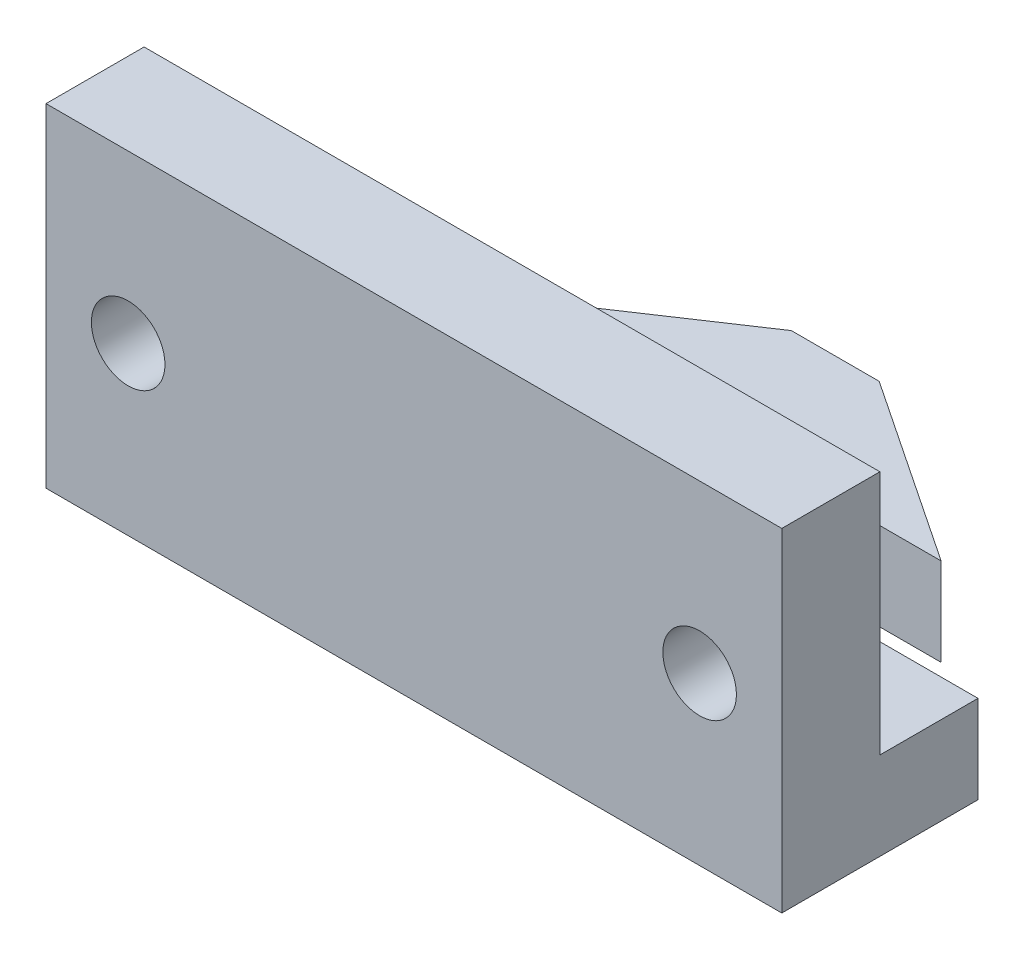
ISO-10303-21;
HEADER;
FILE_DESCRIPTION(('STEP AP214'),'2;1');
FILE_NAME('part.step','',(''),(''),'','','');
FILE_SCHEMA(('AUTOMOTIVE_DESIGN { 1 0 10303 214 1 1 1 1 }'));
ENDSEC;
DATA;
#1=APPLICATION_CONTEXT('core data for automotive mechanical design processes');
#2=APPLICATION_PROTOCOL_DEFINITION('international standard','automotive_design',2000,#1);
#3=PRODUCT_CONTEXT('',#1,'mechanical');
#4=PRODUCT('Part','Part','',(#3));
#5=PRODUCT_RELATED_PRODUCT_CATEGORY('part','',(#4));
#6=PRODUCT_DEFINITION_FORMATION('','',#4);
#7=PRODUCT_DEFINITION_CONTEXT('part definition',#1,'design');
#8=PRODUCT_DEFINITION('design','',#6,#7);
#9=PRODUCT_DEFINITION_SHAPE('','',#8);
#10=(LENGTH_UNIT() NAMED_UNIT(*) SI_UNIT(.MILLI.,.METRE.));
#11=(NAMED_UNIT(*) PLANE_ANGLE_UNIT() SI_UNIT($,.RADIAN.));
#12=(NAMED_UNIT(*) SI_UNIT($,.STERADIAN.) SOLID_ANGLE_UNIT());
#13=UNCERTAINTY_MEASURE_WITH_UNIT(LENGTH_MEASURE(1.E-05),#10,'distance_accuracy_value','');
#14=(GEOMETRIC_REPRESENTATION_CONTEXT(3) GLOBAL_UNCERTAINTY_ASSIGNED_CONTEXT((#13)) GLOBAL_UNIT_ASSIGNED_CONTEXT((#10,
#11,#12)) REPRESENTATION_CONTEXT('',''));
#15=CARTESIAN_POINT('',(0.,0.,0.));
#16=DIRECTION('',(0.,0.,1.));
#17=DIRECTION('',(1.,0.,0.));
#18=AXIS2_PLACEMENT_3D('',#15,#16,#17);
#19=CARTESIAN_POINT('',(0.,3.5814,10.05));
#20=DIRECTION('',(0.,0.,-1.));
#21=DIRECTION('',(-1.,0.,0.));
#22=AXIS2_PLACEMENT_3D('',#19,#20,#21);
#23=PLANE('',#22);
#24=CARTESIAN_POINT('',(-11.65,6.7907,10.05));
#25=DIRECTION('',(0.,0.,1.));
#26=DIRECTION('',(1.,0.,0.));
#27=AXIS2_PLACEMENT_3D('',#24,#25,#26);
#28=CIRCLE('',#27,1.5);
#29=CARTESIAN_POINT('',(-10.15,6.7907,10.05));
#30=VERTEX_POINT('',#29);
#31=EDGE_CURVE('E213',#30,#30,#28,.T.);
#32=ORIENTED_EDGE('',*,*,#31,.F.);
#33=EDGE_LOOP('',(#32));
#34=FACE_BOUND('',#33,.T.);
#35=CARTESIAN_POINT('',(11.65,6.7907,10.05));
#36=DIRECTION('',(0.,0.,1.));
#37=DIRECTION('',(1.,0.,0.));
#38=AXIS2_PLACEMENT_3D('',#35,#36,#37);
#39=CIRCLE('',#38,1.5);
#40=CARTESIAN_POINT('',(13.15,6.7907,10.05));
#41=VERTEX_POINT('',#40);
#42=EDGE_CURVE('E218',#41,#41,#39,.T.);
#43=ORIENTED_EDGE('',*,*,#42,.F.);
#44=EDGE_LOOP('',(#43));
#45=FACE_BOUND('',#44,.T.);
#46=DIRECTION('',(1.,0.,0.));
#47=VECTOR('',#46,1.);
#48=CARTESIAN_POINT('',(0.,0.,10.05));
#49=LINE('',#48,#47);
#50=CARTESIAN_POINT('',(-15.,0.,10.05));
#51=VERTEX_POINT('',#50);
#52=CARTESIAN_POINT('',(15.,0.,10.05));
#53=VERTEX_POINT('',#52);
#54=EDGE_CURVE('E165',#51,#53,#49,.T.);
#55=ORIENTED_EDGE('',*,*,#54,.T.);
#56=DIRECTION('',(0.,-1.,0.));
#57=VECTOR('',#56,1.);
#58=CARTESIAN_POINT('',(15.,3.5814,10.05));
#59=LINE('',#58,#57);
#60=CARTESIAN_POINT('',(15.,13.5814,10.05));
#61=VERTEX_POINT('',#60);
#62=EDGE_CURVE('E11',#61,#53,#59,.T.);
#63=ORIENTED_EDGE('',*,*,#62,.F.);
#64=DIRECTION('',(1.,0.,0.));
#65=VECTOR('',#64,1.);
#66=CARTESIAN_POINT('',(-15.,13.5814,10.05));
#67=LINE('',#66,#65);
#68=CARTESIAN_POINT('',(-15.,13.5814,10.05));
#69=VERTEX_POINT('',#68);
#70=EDGE_CURVE('E228',#69,#61,#67,.T.);
#71=ORIENTED_EDGE('',*,*,#70,.F.);
#72=DIRECTION('',(0.,-1.,0.));
#73=VECTOR('',#72,1.);
#74=CARTESIAN_POINT('',(-15.,3.5814,10.05));
#75=LINE('',#74,#73);
#76=EDGE_CURVE('E164',#69,#51,#75,.T.);
#77=ORIENTED_EDGE('',*,*,#76,.T.);
#78=EDGE_LOOP('',(#55,#63,#71,#77));
#79=FACE_BOUND('',#78,.T.);
#80=ADVANCED_FACE('F36',(#34,#45,#79),#23,.F.);
#81=CARTESIAN_POINT('',(15.,3.5814,0.));
#82=DIRECTION('',(-1.,0.,0.));
#83=DIRECTION('',(0.,0.,1.));
#84=AXIS2_PLACEMENT_3D('',#81,#82,#83);
#85=PLANE('',#84);
#86=DIRECTION('',(0.,0.,-1.));
#87=VECTOR('',#86,1.);
#88=CARTESIAN_POINT('',(15.,0.,0.));
#89=LINE('',#88,#87);
#90=CARTESIAN_POINT('',(15.,0.,2.05));
#91=VERTEX_POINT('',#90);
#92=EDGE_CURVE('E168',#53,#91,#89,.T.);
#93=ORIENTED_EDGE('',*,*,#92,.T.);
#94=DIRECTION('',(0.,-1.,0.));
#95=VECTOR('',#94,1.);
#96=CARTESIAN_POINT('',(15.,3.5814,2.05));
#97=LINE('',#96,#95);
#98=CARTESIAN_POINT('',(15.,3.5814,2.05));
#99=VERTEX_POINT('',#98);
#100=EDGE_CURVE('E44',#99,#91,#97,.T.);
#101=ORIENTED_EDGE('',*,*,#100,.F.);
#102=DIRECTION('',(0.,0.,-1.));
#103=VECTOR('',#102,1.);
#104=CARTESIAN_POINT('',(15.,3.5814,0.));
#105=LINE('',#104,#103);
#106=CARTESIAN_POINT('',(15.,3.5814,6.05));
#107=VERTEX_POINT('',#106);
#108=EDGE_CURVE('E111',#107,#99,#105,.T.);
#109=ORIENTED_EDGE('',*,*,#108,.F.);
#110=DIRECTION('',(0.,-1.,0.));
#111=VECTOR('',#110,1.);
#112=CARTESIAN_POINT('',(15.,13.5814,6.05));
#113=LINE('',#112,#111);
#114=CARTESIAN_POINT('',(15.,13.5814,6.05));
#115=VERTEX_POINT('',#114);
#116=EDGE_CURVE('E169',#115,#107,#113,.T.);
#117=ORIENTED_EDGE('',*,*,#116,.F.);
#118=DIRECTION('',(0.,0.,-1.));
#119=VECTOR('',#118,1.);
#120=CARTESIAN_POINT('',(15.,13.5814,10.05));
#121=LINE('',#120,#119);
#122=EDGE_CURVE('E231',#61,#115,#121,.T.);
#123=ORIENTED_EDGE('',*,*,#122,.F.);
#124=ORIENTED_EDGE('',*,*,#62,.T.);
#125=EDGE_LOOP('',(#93,#101,#109,#117,#123,#124));
#126=FACE_BOUND('',#125,.T.);
#127=ADVANCED_FACE('F279',(#126),#85,.F.);
#128=CARTESIAN_POINT('',(0.,3.5814,2.05));
#129=DIRECTION('',(0.,0.,-1.));
#130=DIRECTION('',(-1.,0.,0.));
#131=AXIS2_PLACEMENT_3D('',#128,#129,#130);
#132=PLANE('',#131);
#133=DIRECTION('',(1.,0.,0.));
#134=VECTOR('',#133,1.);
#135=CARTESIAN_POINT('',(0.,0.,2.05));
#136=LINE('',#135,#134);
#137=CARTESIAN_POINT('',(1.7907,0.,2.05));
#138=VERTEX_POINT('',#137);
#139=EDGE_CURVE('E172',#138,#91,#136,.T.);
#140=ORIENTED_EDGE('',*,*,#139,.F.);
#141=DIRECTION('',(0.,-1.,0.));
#142=VECTOR('',#141,1.);
#143=CARTESIAN_POINT('',(1.7907,3.5814,2.05));
#144=LINE('',#143,#142);
#145=CARTESIAN_POINT('',(1.7907,3.5814,2.05));
#146=VERTEX_POINT('',#145);
#147=EDGE_CURVE('E209',#146,#138,#144,.T.);
#148=ORIENTED_EDGE('',*,*,#147,.F.);
#149=DIRECTION('',(1.,0.,0.));
#150=VECTOR('',#149,1.);
#151=CARTESIAN_POINT('',(0.,3.5814,2.05));
#152=LINE('',#151,#150);
#153=EDGE_CURVE('E244',#146,#99,#152,.T.);
#154=ORIENTED_EDGE('',*,*,#153,.T.);
#155=ORIENTED_EDGE('',*,*,#100,.T.);
#156=EDGE_LOOP('',(#140,#148,#154,#155));
#157=FACE_BOUND('',#156,.T.);
#158=ADVANCED_FACE('F306',(#157),#132,.T.);
#159=CARTESIAN_POINT('',(1.7907,3.5814,0.));
#160=DIRECTION('',(-1.,0.,0.));
#161=DIRECTION('',(0.,0.,1.));
#162=AXIS2_PLACEMENT_3D('',#159,#160,#161);
#163=PLANE('',#162);
#164=DIRECTION('',(0.,0.,-1.));
#165=VECTOR('',#164,1.);
#166=CARTESIAN_POINT('',(1.7907,0.,0.));
#167=LINE('',#166,#165);
#168=CARTESIAN_POINT('',(1.7907,0.,-2.05));
#169=VERTEX_POINT('',#168);
#170=EDGE_CURVE('E175',#138,#169,#167,.T.);
#171=ORIENTED_EDGE('',*,*,#170,.T.);
#172=DIRECTION('',(0.,-1.,0.));
#173=VECTOR('',#172,1.);
#174=CARTESIAN_POINT('',(1.7907,3.5814,-2.05));
#175=LINE('',#174,#173);
#176=CARTESIAN_POINT('',(1.7907,3.5814,-2.05));
#177=VERTEX_POINT('',#176);
#178=EDGE_CURVE('E207',#177,#169,#175,.T.);
#179=ORIENTED_EDGE('',*,*,#178,.F.);
#180=DIRECTION('',(0.,0.,-1.));
#181=VECTOR('',#180,1.);
#182=CARTESIAN_POINT('',(1.7907,3.5814,0.));
#183=LINE('',#182,#181);
#184=EDGE_CURVE('E247',#146,#177,#183,.T.);
#185=ORIENTED_EDGE('',*,*,#184,.F.);
#186=ORIENTED_EDGE('',*,*,#147,.T.);
#187=EDGE_LOOP('',(#171,#179,#185,#186));
#188=FACE_BOUND('',#187,.T.);
#189=ADVANCED_FACE('F313',(#188),#163,.F.);
#190=CARTESIAN_POINT('',(0.,3.5814,-2.05));
#191=DIRECTION('',(0.,0.,1.));
#192=DIRECTION('',(1.,0.,0.));
#193=AXIS2_PLACEMENT_3D('',#190,#191,#192);
#194=PLANE('',#193);
#195=DIRECTION('',(-1.,0.,0.));
#196=VECTOR('',#195,1.);
#197=CARTESIAN_POINT('',(0.,0.,-2.05));
#198=LINE('',#197,#196);
#199=CARTESIAN_POINT('',(9.398,0.,-2.05));
#200=VERTEX_POINT('',#199);
#201=EDGE_CURVE('E178',#200,#169,#198,.T.);
#202=ORIENTED_EDGE('',*,*,#201,.F.);
#203=DIRECTION('',(0.,-1.,0.));
#204=VECTOR('',#203,1.);
#205=CARTESIAN_POINT('',(9.398,3.5814,-2.05));
#206=LINE('',#205,#204);
#207=CARTESIAN_POINT('',(9.398,3.5814,-2.05));
#208=VERTEX_POINT('',#207);
#209=EDGE_CURVE('E205',#208,#200,#206,.T.);
#210=ORIENTED_EDGE('',*,*,#209,.F.);
#211=DIRECTION('',(-1.,0.,0.));
#212=VECTOR('',#211,1.);
#213=CARTESIAN_POINT('',(0.,3.5814,-2.05));
#214=LINE('',#213,#212);
#215=EDGE_CURVE('E249',#208,#177,#214,.T.);
#216=ORIENTED_EDGE('',*,*,#215,.T.);
#217=ORIENTED_EDGE('',*,*,#178,.T.);
#218=EDGE_LOOP('',(#202,#210,#216,#217));
#219=FACE_BOUND('',#218,.T.);
#220=ADVANCED_FACE('F319',(#219),#194,.T.);
#221=CARTESIAN_POINT('',(3.84513522525978,3.5814,-5.75808999982652));
#222=DIRECTION('',(0.555340809590661,0.,-0.831622862362014));
#223=DIRECTION('',(-0.831622862362014,0.,-0.555340809590661));
#224=AXIS2_PLACEMENT_3D('',#221,#222,#223);
#225=PLANE('',#224);
#226=DIRECTION('',(0.831622862362014,0.,0.555340809590661));
#227=VECTOR('',#226,1.);
#228=CARTESIAN_POINT('',(3.84513522525978,0.,-5.75808999982652));
#229=LINE('',#228,#227);
#230=CARTESIAN_POINT('',(1.7907,0.,-7.13));
#231=VERTEX_POINT('',#230);
#232=EDGE_CURVE('E181',#231,#200,#229,.T.);
#233=ORIENTED_EDGE('',*,*,#232,.F.);
#234=DIRECTION('',(0.,-1.,0.));
#235=VECTOR('',#234,1.);
#236=CARTESIAN_POINT('',(1.7907,3.5814,-7.13));
#237=LINE('',#236,#235);
#238=CARTESIAN_POINT('',(1.7907,3.5814,-7.13));
#239=VERTEX_POINT('',#238);
#240=EDGE_CURVE('E203',#239,#231,#237,.T.);
#241=ORIENTED_EDGE('',*,*,#240,.F.);
#242=DIRECTION('',(0.831622862362014,0.,0.555340809590661));
#243=VECTOR('',#242,1.);
#244=CARTESIAN_POINT('',(3.84513522525978,3.5814,-5.75808999982652));
#245=LINE('',#244,#243);
#246=EDGE_CURVE('E252',#239,#208,#245,.T.);
#247=ORIENTED_EDGE('',*,*,#246,.T.);
#248=ORIENTED_EDGE('',*,*,#209,.T.);
#249=EDGE_LOOP('',(#233,#241,#247,#248));
#250=FACE_BOUND('',#249,.T.);
#251=ADVANCED_FACE('F323',(#250),#225,.T.);
#252=CARTESIAN_POINT('',(0.,3.5814,-7.13));
#253=DIRECTION('',(0.,0.,-1.));
#254=DIRECTION('',(-1.,0.,0.));
#255=AXIS2_PLACEMENT_3D('',#252,#253,#254);
#256=PLANE('',#255);
#257=DIRECTION('',(1.,0.,0.));
#258=VECTOR('',#257,1.);
#259=CARTESIAN_POINT('',(0.,0.,-7.13));
#260=LINE('',#259,#258);
#261=CARTESIAN_POINT('',(-1.7907,0.,-7.13));
#262=VERTEX_POINT('',#261);
#263=EDGE_CURVE('E184',#262,#231,#260,.T.);
#264=ORIENTED_EDGE('',*,*,#263,.F.);
#265=DIRECTION('',(0.,-1.,0.));
#266=VECTOR('',#265,1.);
#267=CARTESIAN_POINT('',(-1.7907,3.5814,-7.13));
#268=LINE('',#267,#266);
#269=CARTESIAN_POINT('',(-1.7907,3.5814,-7.13));
#270=VERTEX_POINT('',#269);
#271=EDGE_CURVE('E201',#270,#262,#268,.T.);
#272=ORIENTED_EDGE('',*,*,#271,.F.);
#273=DIRECTION('',(1.,0.,0.));
#274=VECTOR('',#273,1.);
#275=CARTESIAN_POINT('',(0.,3.5814,-7.13));
#276=LINE('',#275,#274);
#277=EDGE_CURVE('E255',#270,#239,#276,.T.);
#278=ORIENTED_EDGE('',*,*,#277,.T.);
#279=ORIENTED_EDGE('',*,*,#240,.T.);
#280=EDGE_LOOP('',(#264,#272,#278,#279));
#281=FACE_BOUND('',#280,.T.);
#282=ADVANCED_FACE('F327',(#281),#256,.T.);
#283=CARTESIAN_POINT('',(-3.84513522525978,3.5814,-5.75808999982652));
#284=DIRECTION('',(-0.555340809590661,0.,-0.831622862362014));
#285=DIRECTION('',(-0.831622862362014,0.,0.555340809590661));
#286=AXIS2_PLACEMENT_3D('',#283,#284,#285);
#287=PLANE('',#286);
#288=DIRECTION('',(0.831622862362014,0.,-0.555340809590661));
#289=VECTOR('',#288,1.);
#290=CARTESIAN_POINT('',(-3.84513522525978,0.,-5.75808999982652));
#291=LINE('',#290,#289);
#292=CARTESIAN_POINT('',(-9.398,0.,-2.05));
#293=VERTEX_POINT('',#292);
#294=EDGE_CURVE('E187',#293,#262,#291,.T.);
#295=ORIENTED_EDGE('',*,*,#294,.F.);
#296=DIRECTION('',(0.,-1.,0.));
#297=VECTOR('',#296,1.);
#298=CARTESIAN_POINT('',(-9.398,3.5814,-2.05));
#299=LINE('',#298,#297);
#300=CARTESIAN_POINT('',(-9.398,3.5814,-2.05));
#301=VERTEX_POINT('',#300);
#302=EDGE_CURVE('E147',#301,#293,#299,.T.);
#303=ORIENTED_EDGE('',*,*,#302,.F.);
#304=DIRECTION('',(0.831622862362014,0.,-0.555340809590661));
#305=VECTOR('',#304,1.);
#306=CARTESIAN_POINT('',(-3.84513522525978,3.5814,-5.75808999982652));
#307=LINE('',#306,#305);
#308=EDGE_CURVE('E155',#301,#270,#307,.T.);
#309=ORIENTED_EDGE('',*,*,#308,.T.);
#310=ORIENTED_EDGE('',*,*,#271,.T.);
#311=EDGE_LOOP('',(#295,#303,#309,#310));
#312=FACE_BOUND('',#311,.T.);
#313=ADVANCED_FACE('F259',(#312),#287,.T.);
#314=CARTESIAN_POINT('',(0.,3.5814,-2.05));
#315=DIRECTION('',(0.,0.,1.));
#316=DIRECTION('',(1.,0.,0.));
#317=AXIS2_PLACEMENT_3D('',#314,#315,#316);
#318=PLANE('',#317);
#319=DIRECTION('',(-1.,0.,0.));
#320=VECTOR('',#319,1.);
#321=CARTESIAN_POINT('',(0.,0.,-2.05));
#322=LINE('',#321,#320);
#323=CARTESIAN_POINT('',(-1.7907,0.,-2.05));
#324=VERTEX_POINT('',#323);
#325=EDGE_CURVE('E142',#324,#293,#322,.T.);
#326=ORIENTED_EDGE('',*,*,#325,.F.);
#327=DIRECTION('',(0.,-1.,0.));
#328=VECTOR('',#327,1.);
#329=CARTESIAN_POINT('',(-1.7907,3.5814,-2.05));
#330=LINE('',#329,#328);
#331=CARTESIAN_POINT('',(-1.7907,3.5814,-2.05));
#332=VERTEX_POINT('',#331);
#333=EDGE_CURVE('E137',#332,#324,#330,.T.);
#334=ORIENTED_EDGE('',*,*,#333,.F.);
#335=DIRECTION('',(-1.,0.,0.));
#336=VECTOR('',#335,1.);
#337=CARTESIAN_POINT('',(0.,3.5814,-2.05));
#338=LINE('',#337,#336);
#339=EDGE_CURVE('E140',#332,#301,#338,.T.);
#340=ORIENTED_EDGE('',*,*,#339,.T.);
#341=ORIENTED_EDGE('',*,*,#302,.T.);
#342=EDGE_LOOP('',(#326,#334,#340,#341));
#343=FACE_BOUND('',#342,.T.);
#344=ADVANCED_FACE('F139',(#343),#318,.T.);
#345=CARTESIAN_POINT('',(-1.7907,3.5814,0.));
#346=DIRECTION('',(-1.,0.,0.));
#347=DIRECTION('',(0.,0.,1.));
#348=AXIS2_PLACEMENT_3D('',#345,#346,#347);
#349=PLANE('',#348);
#350=DIRECTION('',(0.,0.,-1.));
#351=VECTOR('',#350,1.);
#352=CARTESIAN_POINT('',(-1.7907,0.,0.));
#353=LINE('',#352,#351);
#354=CARTESIAN_POINT('',(-1.7907,0.,2.05));
#355=VERTEX_POINT('',#354);
#356=EDGE_CURVE('E191',#355,#324,#353,.T.);
#357=ORIENTED_EDGE('',*,*,#356,.F.);
#358=DIRECTION('',(0.,-1.,0.));
#359=VECTOR('',#358,1.);
#360=CARTESIAN_POINT('',(-1.7907,3.5814,2.05));
#361=LINE('',#360,#359);
#362=CARTESIAN_POINT('',(-1.7907,3.5814,2.05));
#363=VERTEX_POINT('',#362);
#364=EDGE_CURVE('E148',#363,#355,#361,.T.);
#365=ORIENTED_EDGE('',*,*,#364,.F.);
#366=DIRECTION('',(0.,0.,-1.));
#367=VECTOR('',#366,1.);
#368=CARTESIAN_POINT('',(-1.7907,3.5814,0.));
#369=LINE('',#368,#367);
#370=EDGE_CURVE('E152',#363,#332,#369,.T.);
#371=ORIENTED_EDGE('',*,*,#370,.T.);
#372=ORIENTED_EDGE('',*,*,#333,.T.);
#373=EDGE_LOOP('',(#357,#365,#371,#372));
#374=FACE_BOUND('',#373,.T.);
#375=ADVANCED_FACE('F157',(#374),#349,.T.);
#376=CARTESIAN_POINT('',(0.,3.5814,2.05));
#377=DIRECTION('',(0.,0.,1.));
#378=DIRECTION('',(1.,0.,0.));
#379=AXIS2_PLACEMENT_3D('',#376,#377,#378);
#380=PLANE('',#379);
#381=DIRECTION('',(-1.,0.,0.));
#382=VECTOR('',#381,1.);
#383=CARTESIAN_POINT('',(0.,0.,2.05));
#384=LINE('',#383,#382);
#385=CARTESIAN_POINT('',(-15.,0.,2.05));
#386=VERTEX_POINT('',#385);
#387=EDGE_CURVE('E193',#355,#386,#384,.T.);
#388=ORIENTED_EDGE('',*,*,#387,.T.);
#389=DIRECTION('',(0.,-1.,0.));
#390=VECTOR('',#389,1.);
#391=CARTESIAN_POINT('',(-15.,3.5814,2.05));
#392=LINE('',#391,#390);
#393=CARTESIAN_POINT('',(-15.,3.5814,2.05));
#394=VERTEX_POINT('',#393);
#395=EDGE_CURVE('E197',#394,#386,#392,.T.);
#396=ORIENTED_EDGE('',*,*,#395,.F.);
#397=DIRECTION('',(-1.,0.,0.));
#398=VECTOR('',#397,1.);
#399=CARTESIAN_POINT('',(0.,3.5814,2.05));
#400=LINE('',#399,#398);
#401=EDGE_CURVE('E59',#363,#394,#400,.T.);
#402=ORIENTED_EDGE('',*,*,#401,.F.);
#403=ORIENTED_EDGE('',*,*,#364,.T.);
#404=EDGE_LOOP('',(#388,#396,#402,#403));
#405=FACE_BOUND('',#404,.T.);
#406=ADVANCED_FACE('F266',(#405),#380,.F.);
#407=CARTESIAN_POINT('',(-15.,3.5814,0.));
#408=DIRECTION('',(1.,0.,0.));
#409=DIRECTION('',(0.,0.,-1.));
#410=AXIS2_PLACEMENT_3D('',#407,#408,#409);
#411=PLANE('',#410);
#412=DIRECTION('',(0.,0.,1.));
#413=VECTOR('',#412,1.);
#414=CARTESIAN_POINT('',(-15.,0.,0.));
#415=LINE('',#414,#413);
#416=EDGE_CURVE('E106',#386,#51,#415,.T.);
#417=ORIENTED_EDGE('',*,*,#416,.T.);
#418=ORIENTED_EDGE('',*,*,#76,.F.);
#419=DIRECTION('',(0.,0.,1.));
#420=VECTOR('',#419,1.);
#421=CARTESIAN_POINT('',(-15.,13.5814,10.05));
#422=LINE('',#421,#420);
#423=CARTESIAN_POINT('',(-15.,13.5814,6.05));
#424=VERTEX_POINT('',#423);
#425=EDGE_CURVE('E225',#424,#69,#422,.T.);
#426=ORIENTED_EDGE('',*,*,#425,.F.);
#427=DIRECTION('',(0.,-1.,0.));
#428=VECTOR('',#427,1.);
#429=CARTESIAN_POINT('',(-15.,13.5814,6.05));
#430=LINE('',#429,#428);
#431=CARTESIAN_POINT('',(-15.,3.5814,6.05));
#432=VERTEX_POINT('',#431);
#433=EDGE_CURVE('E237',#424,#432,#430,.T.);
#434=ORIENTED_EDGE('',*,*,#433,.T.);
#435=DIRECTION('',(0.,0.,1.));
#436=VECTOR('',#435,1.);
#437=CARTESIAN_POINT('',(-15.,3.5814,0.));
#438=LINE('',#437,#436);
#439=EDGE_CURVE('E159',#394,#432,#438,.T.);
#440=ORIENTED_EDGE('',*,*,#439,.F.);
#441=ORIENTED_EDGE('',*,*,#395,.T.);
#442=EDGE_LOOP('',(#417,#418,#426,#434,#440,#441));
#443=FACE_BOUND('',#442,.T.);
#444=ADVANCED_FACE('F268',(#443),#411,.F.);
#445=CARTESIAN_POINT('',(0.,3.5814,0.));
#446=DIRECTION('',(0.,1.,0.));
#447=DIRECTION('',(0.,0.,1.));
#448=AXIS2_PLACEMENT_3D('',#445,#446,#447);
#449=PLANE('',#448);
#450=DIRECTION('',(-1.,0.,0.));
#451=VECTOR('',#450,1.);
#452=CARTESIAN_POINT('',(-15.,3.5814,6.05));
#453=LINE('',#452,#451);
#454=EDGE_CURVE('E52',#107,#432,#453,.T.);
#455=ORIENTED_EDGE('',*,*,#454,.F.);
#456=ORIENTED_EDGE('',*,*,#108,.T.);
#457=ORIENTED_EDGE('',*,*,#153,.F.);
#458=ORIENTED_EDGE('',*,*,#184,.T.);
#459=ORIENTED_EDGE('',*,*,#215,.F.);
#460=ORIENTED_EDGE('',*,*,#246,.F.);
#461=ORIENTED_EDGE('',*,*,#277,.F.);
#462=ORIENTED_EDGE('',*,*,#308,.F.);
#463=ORIENTED_EDGE('',*,*,#339,.F.);
#464=ORIENTED_EDGE('',*,*,#370,.F.);
#465=ORIENTED_EDGE('',*,*,#401,.T.);
#466=ORIENTED_EDGE('',*,*,#439,.T.);
#467=EDGE_LOOP('',(#455,#456,#457,#458,#459,#460,#461,#462,#463,#464,#465,#466));
#468=FACE_BOUND('',#467,.T.);
#469=ADVANCED_FACE('F151',(#468),#449,.T.);
#470=CARTESIAN_POINT('',(0.,0.,0.));
#471=DIRECTION('',(0.,1.,0.));
#472=DIRECTION('',(0.,0.,1.));
#473=AXIS2_PLACEMENT_3D('',#470,#471,#472);
#474=PLANE('',#473);
#475=ORIENTED_EDGE('',*,*,#54,.F.);
#476=ORIENTED_EDGE('',*,*,#416,.F.);
#477=ORIENTED_EDGE('',*,*,#387,.F.);
#478=ORIENTED_EDGE('',*,*,#356,.T.);
#479=ORIENTED_EDGE('',*,*,#325,.T.);
#480=ORIENTED_EDGE('',*,*,#294,.T.);
#481=ORIENTED_EDGE('',*,*,#263,.T.);
#482=ORIENTED_EDGE('',*,*,#232,.T.);
#483=ORIENTED_EDGE('',*,*,#201,.T.);
#484=ORIENTED_EDGE('',*,*,#170,.F.);
#485=ORIENTED_EDGE('',*,*,#139,.T.);
#486=ORIENTED_EDGE('',*,*,#92,.F.);
#487=EDGE_LOOP('',(#475,#476,#477,#478,#479,#480,#481,#482,#483,#484,#485,#486));
#488=FACE_BOUND('',#487,.T.);
#489=ADVANCED_FACE('F263',(#488),#474,.F.);
#490=CARTESIAN_POINT('',(-15.,13.5814,6.05));
#491=DIRECTION('',(0.,0.,1.));
#492=DIRECTION('',(1.,0.,0.));
#493=AXIS2_PLACEMENT_3D('',#490,#491,#492);
#494=PLANE('',#493);
#495=CARTESIAN_POINT('',(-11.65,6.7907,6.05));
#496=DIRECTION('',(0.,0.,1.));
#497=DIRECTION('',(1.,0.,0.));
#498=AXIS2_PLACEMENT_3D('',#495,#496,#497);
#499=CIRCLE('',#498,1.5);
#500=CARTESIAN_POINT('',(-10.15,6.7907,6.05));
#501=VERTEX_POINT('',#500);
#502=EDGE_CURVE('E39',#501,#501,#499,.T.);
#503=ORIENTED_EDGE('',*,*,#502,.T.);
#504=EDGE_LOOP('',(#503));
#505=FACE_BOUND('',#504,.T.);
#506=CARTESIAN_POINT('',(11.65,6.7907,6.05));
#507=DIRECTION('',(0.,0.,1.));
#508=DIRECTION('',(1.,0.,0.));
#509=AXIS2_PLACEMENT_3D('',#506,#507,#508);
#510=CIRCLE('',#509,1.5);
#511=CARTESIAN_POINT('',(13.15,6.7907,6.05));
#512=VERTEX_POINT('',#511);
#513=EDGE_CURVE('E211',#512,#512,#510,.T.);
#514=ORIENTED_EDGE('',*,*,#513,.T.);
#515=EDGE_LOOP('',(#514));
#516=FACE_BOUND('',#515,.T.);
#517=ORIENTED_EDGE('',*,*,#454,.T.);
#518=ORIENTED_EDGE('',*,*,#433,.F.);
#519=DIRECTION('',(-1.,0.,0.));
#520=VECTOR('',#519,1.);
#521=CARTESIAN_POINT('',(-15.,13.5814,6.05));
#522=LINE('',#521,#520);
#523=EDGE_CURVE('E234',#115,#424,#522,.T.);
#524=ORIENTED_EDGE('',*,*,#523,.F.);
#525=ORIENTED_EDGE('',*,*,#116,.T.);
#526=EDGE_LOOP('',(#517,#518,#524,#525));
#527=FACE_BOUND('',#526,.T.);
#528=ADVANCED_FACE('F273',(#505,#516,#527),#494,.F.);
#529=CARTESIAN_POINT('',(0.,13.5814,0.));
#530=DIRECTION('',(0.,-1.,0.));
#531=DIRECTION('',(0.,0.,-1.));
#532=AXIS2_PLACEMENT_3D('',#529,#530,#531);
#533=PLANE('',#532);
#534=ORIENTED_EDGE('',*,*,#425,.T.);
#535=ORIENTED_EDGE('',*,*,#70,.T.);
#536=ORIENTED_EDGE('',*,*,#122,.T.);
#537=ORIENTED_EDGE('',*,*,#523,.T.);
#538=EDGE_LOOP('',(#534,#535,#536,#537));
#539=FACE_BOUND('',#538,.T.);
#540=ADVANCED_FACE('F288',(#539),#533,.F.);
#541=CARTESIAN_POINT('',(11.65,6.7907,0.));
#542=DIRECTION('',(0.,0.,1.));
#543=DIRECTION('',(1.,0.,0.));
#544=AXIS2_PLACEMENT_3D('',#541,#542,#543);
#545=CYLINDRICAL_SURFACE('',#544,1.5);
#546=ORIENTED_EDGE('',*,*,#42,.T.);
#547=EDGE_LOOP('',(#546));
#548=FACE_BOUND('',#547,.T.);
#549=ORIENTED_EDGE('',*,*,#513,.F.);
#550=EDGE_LOOP('',(#549));
#551=FACE_BOUND('',#550,.T.);
#552=ADVANCED_FACE('F290',(#548,#551),#545,.F.);
#553=CARTESIAN_POINT('',(-11.65,6.7907,0.));
#554=DIRECTION('',(0.,0.,1.));
#555=DIRECTION('',(1.,0.,0.));
#556=AXIS2_PLACEMENT_3D('',#553,#554,#555);
#557=CYLINDRICAL_SURFACE('',#556,1.5);
#558=ORIENTED_EDGE('',*,*,#31,.T.);
#559=EDGE_LOOP('',(#558));
#560=FACE_BOUND('',#559,.T.);
#561=ORIENTED_EDGE('',*,*,#502,.F.);
#562=EDGE_LOOP('',(#561));
#563=FACE_BOUND('',#562,.T.);
#564=ADVANCED_FACE('F296',(#560,#563),#557,.F.);
#565=CLOSED_SHELL('',(#80,#127,#158,#189,#220,#251,#282,#313,#344,#375,#406,#444,#469,#489,#528,
#540,#552,#564));
#566=MANIFOLD_SOLID_BREP('B2',#565);
#567=ADVANCED_BREP_SHAPE_REPRESENTATION('',(#18,#566),#14);
#568=SHAPE_DEFINITION_REPRESENTATION(#9,#567);
ENDSEC;
END-ISO-10303-21;
